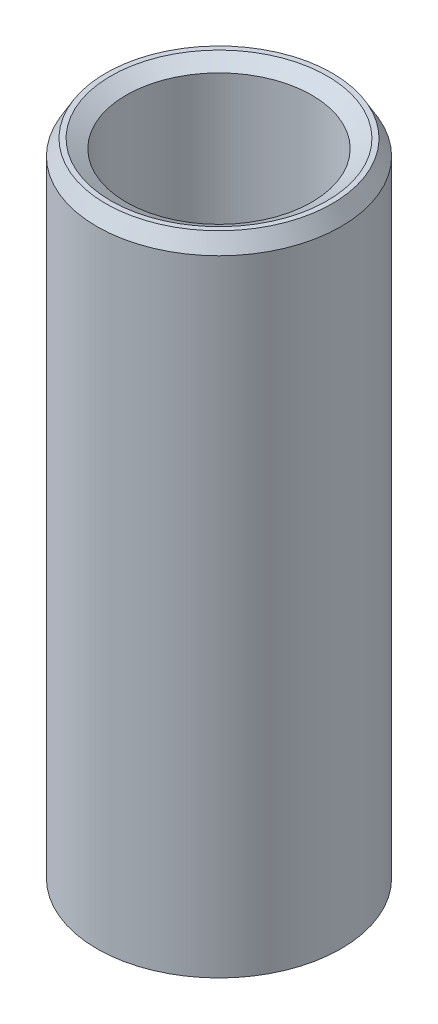
ISO-10303-21;
HEADER;
FILE_DESCRIPTION(('STEP AP214'),'2;1');
FILE_NAME('part.step','',(''),(''),'','','');
FILE_SCHEMA(('AUTOMOTIVE_DESIGN { 1 0 10303 214 1 1 1 1 }'));
ENDSEC;
DATA;
#1=APPLICATION_CONTEXT('core data for automotive mechanical design processes');
#2=APPLICATION_PROTOCOL_DEFINITION('international standard','automotive_design',2000,#1);
#3=PRODUCT_CONTEXT('',#1,'mechanical');
#4=PRODUCT('Part','Part','',(#3));
#5=PRODUCT_RELATED_PRODUCT_CATEGORY('part','',(#4));
#6=PRODUCT_DEFINITION_FORMATION('','',#4);
#7=PRODUCT_DEFINITION_CONTEXT('part definition',#1,'design');
#8=PRODUCT_DEFINITION('design','',#6,#7);
#9=PRODUCT_DEFINITION_SHAPE('','',#8);
#10=(LENGTH_UNIT() NAMED_UNIT(*) SI_UNIT(.MILLI.,.METRE.));
#11=(NAMED_UNIT(*) PLANE_ANGLE_UNIT() SI_UNIT($,.RADIAN.));
#12=(NAMED_UNIT(*) SI_UNIT($,.STERADIAN.) SOLID_ANGLE_UNIT());
#13=UNCERTAINTY_MEASURE_WITH_UNIT(LENGTH_MEASURE(1.E-05),#10,'distance_accuracy_value','');
#14=(GEOMETRIC_REPRESENTATION_CONTEXT(3) GLOBAL_UNCERTAINTY_ASSIGNED_CONTEXT((#13)) GLOBAL_UNIT_ASSIGNED_CONTEXT((#10,
#11,#12)) REPRESENTATION_CONTEXT('',''));
#15=CARTESIAN_POINT('',(0.,0.,0.));
#16=DIRECTION('',(0.,0.,1.));
#17=DIRECTION('',(1.,0.,0.));
#18=AXIS2_PLACEMENT_3D('',#15,#16,#17);
#19=CARTESIAN_POINT('',(0.,159.694758176673,0.));
#20=DIRECTION('',(0.,-1.,0.));
#21=DIRECTION('',(0.,0.,-1.));
#22=AXIS2_PLACEMENT_3D('',#19,#20,#21);
#23=CYLINDRICAL_SURFACE('',#22,30.);
#24=CARTESIAN_POINT('',(0.,2.18236301228511,0.));
#25=DIRECTION('',(0.,1.,0.));
#26=DIRECTION('',(0.,0.,1.));
#27=AXIS2_PLACEMENT_3D('',#24,#25,#26);
#28=CIRCLE('',#27,30.);
#29=CARTESIAN_POINT('',(0.,2.18236301228511,-30.));
#30=VERTEX_POINT('',#29);
#31=EDGE_CURVE('E10',#30,#30,#28,.T.);
#32=CARTESIAN_POINT('',(0.,155.914794558837,0.));
#33=DIRECTION('',(0.,1.,0.));
#34=DIRECTION('',(0.,0.,1.));
#35=AXIS2_PLACEMENT_3D('',#32,#33,#34);
#36=CIRCLE('',#35,30.);
#37=CARTESIAN_POINT('',(0.,155.914794558837,-30.));
#38=VERTEX_POINT('',#37);
#39=EDGE_CURVE('E50',#38,#38,#36,.F.);
#40=CARTESIAN_POINT('',(0.,2.18236301228511,-30.));
#41=CARTESIAN_POINT('',(0.,3.78374250756168,-30.));
#42=CARTESIAN_POINT('',(0.,5.38512200283826,-30.));
#43=CARTESIAN_POINT('',(0.,8.58788099339142,-30.));
#44=CARTESIAN_POINT('',(0.,10.189260488668,-30.));
#45=CARTESIAN_POINT('',(0.,13.3920194792212,-30.));
#46=CARTESIAN_POINT('',(0.,14.9933989744977,-30.));
#47=CARTESIAN_POINT('',(0.,18.1961579650509,-30.));
#48=CARTESIAN_POINT('',(0.,19.7975374603275,-30.));
#49=CARTESIAN_POINT('',(0.,23.0002964508806,-30.));
#50=CARTESIAN_POINT('',(0.,24.6016759461572,-30.));
#51=CARTESIAN_POINT('',(0.,27.8044349367104,-30.));
#52=CARTESIAN_POINT('',(0.,29.4058144319869,-30.));
#53=CARTESIAN_POINT('',(0.,32.6085734225401,-30.));
#54=CARTESIAN_POINT('',(0.,34.2099529178167,-30.));
#55=CARTESIAN_POINT('',(0.,37.4127119083698,-30.));
#56=CARTESIAN_POINT('',(0.,39.0140914036464,-30.));
#57=CARTESIAN_POINT('',(0.,42.2168503941996,-30.));
#58=CARTESIAN_POINT('',(0.,43.8182298894761,-30.));
#59=CARTESIAN_POINT('',(0.,47.0209888800293,-30.));
#60=CARTESIAN_POINT('',(0.,48.6223683753059,-30.));
#61=CARTESIAN_POINT('',(0.,51.825127365859,-30.));
#62=CARTESIAN_POINT('',(0.,53.4265068611356,-30.));
#63=CARTESIAN_POINT('',(0.,56.6292658516888,-30.));
#64=CARTESIAN_POINT('',(0.,58.2306453469654,-30.));
#65=CARTESIAN_POINT('',(0.,61.4334043375185,-30.));
#66=CARTESIAN_POINT('',(0.,63.0347838327951,-30.));
#67=CARTESIAN_POINT('',(0.,66.2375428233482,-30.));
#68=CARTESIAN_POINT('',(0.,67.8389223186248,-30.));
#69=CARTESIAN_POINT('',(0.,71.041681309178,-30.));
#70=CARTESIAN_POINT('',(0.,72.6430608044545,-30.));
#71=CARTESIAN_POINT('',(0.,75.8458197950077,-30.));
#72=CARTESIAN_POINT('',(0.,77.4471992902843,-30.));
#73=CARTESIAN_POINT('',(0.,80.6499582808375,-30.));
#74=CARTESIAN_POINT('',(0.,82.251337776114,-30.));
#75=CARTESIAN_POINT('',(0.,85.4540967666672,-30.));
#76=CARTESIAN_POINT('',(0.,87.0554762619438,-30.));
#77=CARTESIAN_POINT('',(0.,90.2582352524969,-30.));
#78=CARTESIAN_POINT('',(0.,91.8596147477735,-30.));
#79=CARTESIAN_POINT('',(0.,95.0623737383267,-30.));
#80=CARTESIAN_POINT('',(0.,96.6637532336032,-30.));
#81=CARTESIAN_POINT('',(0.,99.8665122241564,-30.));
#82=CARTESIAN_POINT('',(0.,101.467891719433,-30.));
#83=CARTESIAN_POINT('',(0.,104.670650709986,-30.));
#84=CARTESIAN_POINT('',(0.,106.272030205263,-30.));
#85=CARTESIAN_POINT('',(0.,109.474789195816,-30.));
#86=CARTESIAN_POINT('',(0.,111.076168691092,-30.));
#87=CARTESIAN_POINT('',(0.,114.278927681646,-30.));
#88=CARTESIAN_POINT('',(0.,115.880307176922,-30.));
#89=CARTESIAN_POINT('',(0.,119.083066167475,-30.));
#90=CARTESIAN_POINT('',(0.,120.684445662752,-30.));
#91=CARTESIAN_POINT('',(0.,123.887204653305,-30.));
#92=CARTESIAN_POINT('',(0.,125.488584148582,-30.));
#93=CARTESIAN_POINT('',(0.,128.691343139135,-30.));
#94=CARTESIAN_POINT('',(0.,130.292722634411,-30.));
#95=CARTESIAN_POINT('',(0.,133.495481624965,-30.));
#96=CARTESIAN_POINT('',(0.,135.096861120241,-30.));
#97=CARTESIAN_POINT('',(0.,138.299620110794,-30.));
#98=CARTESIAN_POINT('',(0.,139.900999606071,-30.));
#99=CARTESIAN_POINT('',(0.,143.103758596624,-30.));
#100=CARTESIAN_POINT('',(0.,144.705138091901,-30.));
#101=CARTESIAN_POINT('',(0.,147.907897082454,-30.));
#102=CARTESIAN_POINT('',(0.,149.50927657773,-30.));
#103=CARTESIAN_POINT('',(0.,152.712035568284,-30.));
#104=CARTESIAN_POINT('',(0.,154.31341506356,-30.));
#105=CARTESIAN_POINT('',(0.,155.914794558837,-30.));
#106=B_SPLINE_CURVE_WITH_KNOTS('',3,(#40,#41,#42,#43,#44,#45,#46,#47,#48,#49,#50,#51,#52,#53,
#54,#55,#56,#57,#58,#59,#60,#61,#62,#63,#64,#65,#66,#67,#68,#69,#70,#71,#72,#73,#74,#75,#76,#77,
#78,#79,#80,#81,#82,#83,#84,#85,#86,#87,#88,#89,#90,#91,#92,#93,#94,#95,#96,#97,#98,#99,#100,
#101,#102,#103,#104,#105),.UNSPECIFIED.,.F.,.F.,(4,2,2,2,2,2,2,2,2,2,2,2,2,2,2,2,2,2,2,2,2,2,2,
2,2,2,2,2,2,2,2,2,4),(0.,4.80413848582972,9.60827697165947,14.4124154574892,19.2165539433189,
24.0206924291487,28.8248309149784,33.6289694008081,38.4331078866379,43.2372463724676,
48.0413848582974,52.8455233441271,57.6496618299568,62.4538003157866,67.2579388016163,
72.062077287446,76.8662157732758,81.6703542591055,86.4744927449352,91.278631230765,
96.0827697165947,100.886908202424,105.691046688254,110.495185174084,115.299323659914,
120.103462145743,124.907600631573,129.711739117403,134.515877603233,139.320016089062,
144.124154574892,148.928293060722,153.732431546552),.UNSPECIFIED.);
#107=EDGE_CURVE('BSEAM39',#30,#38,#106,.T.);
#108=ORIENTED_EDGE('',*,*,#31,.T.);
#109=ORIENTED_EDGE('',*,*,#39,.T.);
#110=ORIENTED_EDGE('',*,*,#107,.T.);
#111=ORIENTED_EDGE('',*,*,#107,.F.);
#112=EDGE_LOOP('',(#108,#110,#109,#111));
#113=FACE_BOUND('',#112,.T.);
#114=ADVANCED_FACE('F39',(#113),#23,.T.);
#115=CARTESIAN_POINT('',(0.,159.694758176673,0.));
#116=DIRECTION('',(0.,1.,0.));
#117=DIRECTION('',(0.,0.,1.));
#118=AXIS2_PLACEMENT_3D('',#115,#116,#117);
#119=PLANE('',#118);
#120=CARTESIAN_POINT('',(0.,159.694758176673,0.));
#121=DIRECTION('',(0.,1.,0.));
#122=DIRECTION('',(0.,0.,1.));
#123=AXIS2_PLACEMENT_3D('',#120,#121,#122);
#124=CIRCLE('',#123,26.587240065182);
#125=CARTESIAN_POINT('',(0.,159.694758176673,26.587240065182));
#126=VERTEX_POINT('',#125);
#127=EDGE_CURVE('E58',#126,#126,#124,.F.);
#128=ORIENTED_EDGE('',*,*,#127,.T.);
#129=EDGE_LOOP('',(#128));
#130=FACE_BOUND('',#129,.T.);
#131=CARTESIAN_POINT('',(0.,159.694758176673,0.));
#132=DIRECTION('',(0.,1.,0.));
#133=DIRECTION('',(0.,0.,1.));
#134=AXIS2_PLACEMENT_3D('',#131,#132,#133);
#135=CIRCLE('',#134,27.8176369877151);
#136=CARTESIAN_POINT('',(0.,159.694758176673,27.8176369877151));
#137=VERTEX_POINT('',#136);
#138=EDGE_CURVE('E61',#137,#137,#135,.T.);
#139=ORIENTED_EDGE('',*,*,#138,.T.);
#140=EDGE_LOOP('',(#139));
#141=FACE_BOUND('',#140,.T.);
#142=ADVANCED_FACE('F88',(#130,#141),#119,.T.);
#143=CARTESIAN_POINT('',(0.,0.,0.));
#144=DIRECTION('',(0.,1.,0.));
#145=DIRECTION('',(0.,0.,1.));
#146=AXIS2_PLACEMENT_3D('',#143,#144,#145);
#147=PLANE('',#146);
#148=CARTESIAN_POINT('',(0.,0.,0.));
#149=DIRECTION('',(0.,1.,0.));
#150=DIRECTION('',(0.,0.,1.));
#151=AXIS2_PLACEMENT_3D('',#148,#149,#150);
#152=CIRCLE('',#151,24.9896394596301);
#153=CARTESIAN_POINT('',(0.,0.,24.9896394596301));
#154=VERTEX_POINT('',#153);
#155=EDGE_CURVE('E51',#154,#154,#152,.T.);
#156=ORIENTED_EDGE('',*,*,#155,.T.);
#157=EDGE_LOOP('',(#156));
#158=FACE_BOUND('',#157,.T.);
#159=CARTESIAN_POINT('',(0.,0.,0.));
#160=DIRECTION('',(0.,1.,0.));
#161=DIRECTION('',(0.,0.,1.));
#162=AXIS2_PLACEMENT_3D('',#159,#160,#161);
#163=CIRCLE('',#162,26.2200363821631);
#164=CARTESIAN_POINT('',(0.,0.,26.2200363821631));
#165=VERTEX_POINT('',#164);
#166=EDGE_CURVE('E54',#165,#165,#163,.F.);
#167=ORIENTED_EDGE('',*,*,#166,.T.);
#168=EDGE_LOOP('',(#167));
#169=FACE_BOUND('',#168,.T.);
#170=ADVANCED_FACE('F83',(#158,#169),#147,.F.);
#171=CARTESIAN_POINT('',(0.,159.694758176673,0.));
#172=DIRECTION('',(0.,-1.,0.));
#173=DIRECTION('',(0.,0.,-1.));
#174=AXIS2_PLACEMENT_3D('',#171,#172,#173);
#175=CYLINDRICAL_SURFACE('',#174,22.8072764473451);
#176=CARTESIAN_POINT('',(0.,157.512395164388,0.));
#177=DIRECTION('',(0.,1.,0.));
#178=DIRECTION('',(0.,0.,1.));
#179=AXIS2_PLACEMENT_3D('',#176,#177,#178);
#180=CIRCLE('',#179,22.8072764473451);
#181=CARTESIAN_POINT('',(0.,157.512395164388,-22.8072764473451));
#182=VERTEX_POINT('',#181);
#183=EDGE_CURVE('E67',#182,#182,#180,.T.);
#184=CARTESIAN_POINT('',(0.,3.77996361783678,0.));
#185=DIRECTION('',(0.,1.,0.));
#186=DIRECTION('',(0.,0.,1.));
#187=AXIS2_PLACEMENT_3D('',#184,#185,#186);
#188=CIRCLE('',#187,22.8072764473451);
#189=CARTESIAN_POINT('',(0.,3.77996361783675,-22.8072764473451));
#190=VERTEX_POINT('',#189);
#191=EDGE_CURVE('E69',#190,#190,#188,.F.);
#192=CARTESIAN_POINT('',(0.,157.512395164388,-22.8072764473451));
#193=CARTESIAN_POINT('',(0.,155.911015669112,-22.8072764473451));
#194=CARTESIAN_POINT('',(0.,154.309636173835,-22.8072764473451));
#195=CARTESIAN_POINT('',(0.,151.106877183282,-22.8072764473451));
#196=CARTESIAN_POINT('',(0.,149.505497688005,-22.8072764473451));
#197=CARTESIAN_POINT('',(0.,146.302738697452,-22.8072764473451));
#198=CARTESIAN_POINT('',(0.,144.701359202175,-22.8072764473451));
#199=CARTESIAN_POINT('',(0.,141.498600211622,-22.8072764473451));
#200=CARTESIAN_POINT('',(0.,139.897220716346,-22.8072764473451));
#201=CARTESIAN_POINT('',(0.,136.694461725793,-22.8072764473451));
#202=CARTESIAN_POINT('',(0.,135.093082230516,-22.8072764473451));
#203=CARTESIAN_POINT('',(0.,131.890323239963,-22.8072764473451));
#204=CARTESIAN_POINT('',(0.,130.288943744686,-22.8072764473451));
#205=CARTESIAN_POINT('',(0.,127.086184754133,-22.8072764473451));
#206=CARTESIAN_POINT('',(0.,125.484805258857,-22.8072764473451));
#207=CARTESIAN_POINT('',(0.,122.282046268303,-22.8072764473451));
#208=CARTESIAN_POINT('',(0.,120.680666773027,-22.8072764473451));
#209=CARTESIAN_POINT('',(0.,117.477907782474,-22.8072764473451));
#210=CARTESIAN_POINT('',(0.,115.876528287197,-22.8072764473451));
#211=CARTESIAN_POINT('',(0.,112.673769296644,-22.8072764473451));
#212=CARTESIAN_POINT('',(0.,111.072389801367,-22.8072764473451));
#213=CARTESIAN_POINT('',(0.,107.869630810814,-22.8072764473451));
#214=CARTESIAN_POINT('',(0.,106.268251315538,-22.8072764473451));
#215=CARTESIAN_POINT('',(0.,103.065492324985,-22.8072764473451));
#216=CARTESIAN_POINT('',(0.,101.464112829708,-22.8072764473451));
#217=CARTESIAN_POINT('',(0.,98.2613538391548,-22.8072764473451));
#218=CARTESIAN_POINT('',(0.,96.6599743438782,-22.8072764473451));
#219=CARTESIAN_POINT('',(0.,93.457215353325,-22.8072764473451));
#220=CARTESIAN_POINT('',(0.,91.8558358580485,-22.8072764473451));
#221=CARTESIAN_POINT('',(0.,88.6530768674953,-22.8072764473451));
#222=CARTESIAN_POINT('',(0.,87.0516973722187,-22.8072764473451));
#223=CARTESIAN_POINT('',(0.,83.8489383816656,-22.8072764473451));
#224=CARTESIAN_POINT('',(0.,82.247558886389,-22.8072764473451));
#225=CARTESIAN_POINT('',(0.,79.0447998958359,-22.8072764473451));
#226=CARTESIAN_POINT('',(0.,77.4434204005593,-22.8072764473451));
#227=CARTESIAN_POINT('',(0.,74.2406614100061,-22.8072764473451));
#228=CARTESIAN_POINT('',(0.,72.6392819147296,-22.8072764473451));
#229=CARTESIAN_POINT('',(0.,69.4365229241764,-22.8072764473451));
#230=CARTESIAN_POINT('',(0.,67.8351434288998,-22.8072764473451));
#231=CARTESIAN_POINT('',(0.,64.6323844383467,-22.8072764473451));
#232=CARTESIAN_POINT('',(0.,63.0310049430701,-22.8072764473451));
#233=CARTESIAN_POINT('',(0.,59.8282459525169,-22.8072764473451));
#234=CARTESIAN_POINT('',(0.,58.2268664572404,-22.8072764473451));
#235=CARTESIAN_POINT('',(0.,55.0241074666872,-22.8072764473451));
#236=CARTESIAN_POINT('',(0.,53.4227279714106,-22.8072764473451));
#237=CARTESIAN_POINT('',(0.,50.2199689808575,-22.8072764473451));
#238=CARTESIAN_POINT('',(0.,48.6185894855809,-22.8072764473451));
#239=CARTESIAN_POINT('',(0.,45.4158304950277,-22.8072764473451));
#240=CARTESIAN_POINT('',(0.,43.8144509997512,-22.8072764473451));
#241=CARTESIAN_POINT('',(0.,40.611692009198,-22.8072764473451));
#242=CARTESIAN_POINT('',(0.,39.0103125139214,-22.8072764473451));
#243=CARTESIAN_POINT('',(0.,35.8075535233683,-22.8072764473451));
#244=CARTESIAN_POINT('',(0.,34.2061740280917,-22.8072764473451));
#245=CARTESIAN_POINT('',(0.,31.0034150375386,-22.8072764473451));
#246=CARTESIAN_POINT('',(0.,29.402035542262,-22.8072764473451));
#247=CARTESIAN_POINT('',(0.,26.1992765517088,-22.8072764473451));
#248=CARTESIAN_POINT('',(0.,24.5978970564323,-22.8072764473451));
#249=CARTESIAN_POINT('',(0.,21.3951380658791,-22.8072764473451));
#250=CARTESIAN_POINT('',(0.,19.7937585706025,-22.8072764473451));
#251=CARTESIAN_POINT('',(0.,16.5909995800494,-22.8072764473451));
#252=CARTESIAN_POINT('',(0.,14.9896200847728,-22.8072764473451));
#253=CARTESIAN_POINT('',(0.,11.7868610942196,-22.8072764473451));
#254=CARTESIAN_POINT('',(0.,10.185481598943,-22.8072764473451));
#255=CARTESIAN_POINT('',(0.,6.9827226083899,-22.8072764473451));
#256=CARTESIAN_POINT('',(0.,5.38134311311333,-22.8072764473451));
#257=CARTESIAN_POINT('',(0.,3.77996361783675,-22.8072764473451));
#258=B_SPLINE_CURVE_WITH_KNOTS('',3,(#192,#193,#194,#195,#196,#197,#198,#199,#200,#201,#202,
#203,#204,#205,#206,#207,#208,#209,#210,#211,#212,#213,#214,#215,#216,#217,#218,#219,#220,#221,
#222,#223,#224,#225,#226,#227,#228,#229,#230,#231,#232,#233,#234,#235,#236,#237,#238,#239,#240,
#241,#242,#243,#244,#245,#246,#247,#248,#249,#250,#251,#252,#253,#254,#255,#256,#257),
.UNSPECIFIED.,.F.,.F.,(4,2,2,2,2,2,2,2,2,2,2,2,2,2,2,2,2,2,2,2,2,2,2,2,2,2,2,2,2,2,2,2,4),(0.,
4.80413848582975,9.60827697165947,14.4124154574892,19.2165539433189,24.0206924291487,
28.8248309149784,33.6289694008081,38.4331078866378,43.2372463724676,48.0413848582973,
52.845523344127,57.6496618299568,62.4538003157865,67.2579388016162,72.062077287446,
76.8662157732757,81.6703542591054,86.4744927449351,91.2786312307649,96.0827697165946,
100.886908202424,105.691046688254,110.495185174084,115.299323659914,120.103462145743,
124.907600631573,129.711739117403,134.515877603232,139.320016089062,144.124154574892,
148.928293060722,153.732431546551),.UNSPECIFIED.);
#259=EDGE_CURVE('BSEAM71',#182,#190,#258,.T.);
#260=ORIENTED_EDGE('',*,*,#183,.T.);
#261=ORIENTED_EDGE('',*,*,#191,.T.);
#262=ORIENTED_EDGE('',*,*,#259,.T.);
#263=ORIENTED_EDGE('',*,*,#259,.F.);
#264=EDGE_LOOP('',(#260,#262,#261,#263));
#265=FACE_BOUND('',#264,.T.);
#266=ADVANCED_FACE('F71',(#265),#175,.F.);
#267=CARTESIAN_POINT('',(0.,157.512395164388,0.));
#268=DIRECTION('',(0.,1.,0.));
#269=DIRECTION('',(0.,0.,1.));
#270=AXIS2_PLACEMENT_3D('',#267,#268,#269);
#271=CONICAL_SURFACE('',#270,22.8072764473451,1.0471975511966);
#272=ORIENTED_EDGE('',*,*,#127,.F.);
#273=EDGE_LOOP('',(#272));
#274=FACE_BOUND('',#273,.T.);
#275=ORIENTED_EDGE('',*,*,#183,.F.);
#276=EDGE_LOOP('',(#275));
#277=FACE_BOUND('',#276,.T.);
#278=ADVANCED_FACE('F77',(#274,#277),#271,.F.);
#279=CARTESIAN_POINT('',(0.,0.,0.));
#280=DIRECTION('',(0.,-1.,0.));
#281=DIRECTION('',(0.,0.,-1.));
#282=AXIS2_PLACEMENT_3D('',#279,#280,#281);
#283=CONICAL_SURFACE('',#282,24.9896394596301,0.523598775598294);
#284=ORIENTED_EDGE('',*,*,#191,.F.);
#285=EDGE_LOOP('',(#284));
#286=FACE_BOUND('',#285,.T.);
#287=ORIENTED_EDGE('',*,*,#155,.F.);
#288=EDGE_LOOP('',(#287));
#289=FACE_BOUND('',#288,.T.);
#290=ADVANCED_FACE('F73',(#286,#289),#283,.F.);
#291=CARTESIAN_POINT('',(0.,2.18236301228511,0.));
#292=DIRECTION('',(0.,1.,0.));
#293=DIRECTION('',(0.,0.,1.));
#294=AXIS2_PLACEMENT_3D('',#291,#292,#293);
#295=CONICAL_SURFACE('',#294,30.,1.0471975511966);
#296=ORIENTED_EDGE('',*,*,#166,.F.);
#297=EDGE_LOOP('',(#296));
#298=FACE_BOUND('',#297,.T.);
#299=ORIENTED_EDGE('',*,*,#31,.F.);
#300=EDGE_LOOP('',(#299));
#301=FACE_BOUND('',#300,.T.);
#302=ADVANCED_FACE('F76',(#298,#301),#295,.T.);
#303=CARTESIAN_POINT('',(0.,159.694758176673,0.));
#304=DIRECTION('',(0.,-1.,0.));
#305=DIRECTION('',(0.,0.,-1.));
#306=AXIS2_PLACEMENT_3D('',#303,#304,#305);
#307=CONICAL_SURFACE('',#306,27.8176369877151,0.523598775598297);
#308=ORIENTED_EDGE('',*,*,#39,.F.);
#309=EDGE_LOOP('',(#308));
#310=FACE_BOUND('',#309,.T.);
#311=ORIENTED_EDGE('',*,*,#138,.F.);
#312=EDGE_LOOP('',(#311));
#313=FACE_BOUND('',#312,.T.);
#314=ADVANCED_FACE('F45',(#310,#313),#307,.T.);
#315=CLOSED_SHELL('',(#114,#142,#170,#266,#278,#290,#302,#314));
#316=MANIFOLD_SOLID_BREP('B2',#315);
#317=ADVANCED_BREP_SHAPE_REPRESENTATION('',(#18,#316),#14);
#318=SHAPE_DEFINITION_REPRESENTATION(#9,#317);
ENDSEC;
END-ISO-10303-21;
